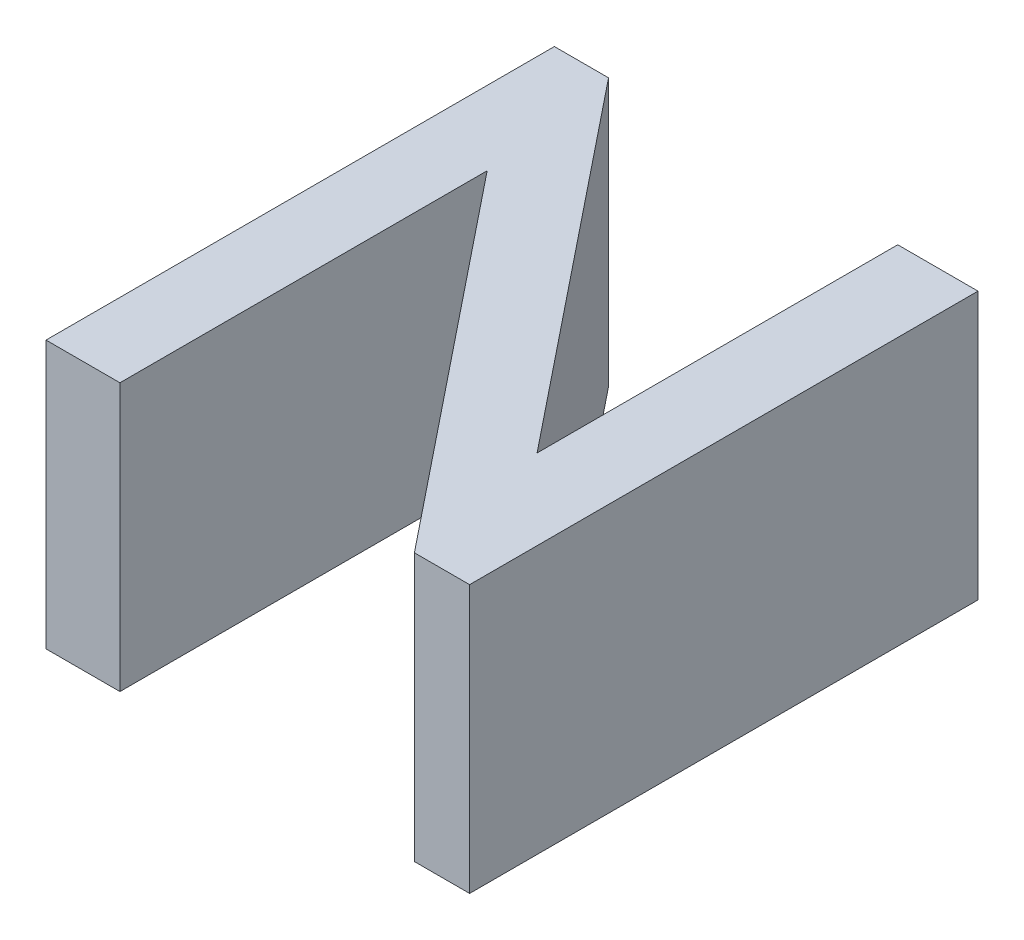
ISO-10303-21;
HEADER;
FILE_DESCRIPTION(('STEP AP214'),'2;1');
FILE_NAME('part.step','',(''),(''),'','','');
FILE_SCHEMA(('AUTOMOTIVE_DESIGN { 1 0 10303 214 1 1 1 1 }'));
ENDSEC;
DATA;
#1=APPLICATION_CONTEXT('core data for automotive mechanical design processes');
#2=APPLICATION_PROTOCOL_DEFINITION('international standard','automotive_design',2000,#1);
#3=PRODUCT_CONTEXT('',#1,'mechanical');
#4=PRODUCT('Part','Part','',(#3));
#5=PRODUCT_RELATED_PRODUCT_CATEGORY('part','',(#4));
#6=PRODUCT_DEFINITION_FORMATION('','',#4);
#7=PRODUCT_DEFINITION_CONTEXT('part definition',#1,'design');
#8=PRODUCT_DEFINITION('design','',#6,#7);
#9=PRODUCT_DEFINITION_SHAPE('','',#8);
#10=(LENGTH_UNIT() NAMED_UNIT(*) SI_UNIT(.MILLI.,.METRE.));
#11=(NAMED_UNIT(*) PLANE_ANGLE_UNIT() SI_UNIT($,.RADIAN.));
#12=(NAMED_UNIT(*) SI_UNIT($,.STERADIAN.) SOLID_ANGLE_UNIT());
#13=UNCERTAINTY_MEASURE_WITH_UNIT(LENGTH_MEASURE(1.E-05),#10,'distance_accuracy_value','');
#14=(GEOMETRIC_REPRESENTATION_CONTEXT(3) GLOBAL_UNCERTAINTY_ASSIGNED_CONTEXT((#13)) GLOBAL_UNIT_ASSIGNED_CONTEXT((#10,
#11,#12)) REPRESENTATION_CONTEXT('',''));
#15=CARTESIAN_POINT('',(0.,0.,0.));
#16=DIRECTION('',(0.,0.,1.));
#17=DIRECTION('',(1.,0.,0.));
#18=AXIS2_PLACEMENT_3D('',#15,#16,#17);
#19=CARTESIAN_POINT('',(260.079347522779,10.,-70.0192436771193));
#20=DIRECTION('',(-1.,0.,0.));
#21=DIRECTION('',(0.,0.,1.));
#22=AXIS2_PLACEMENT_3D('',#19,#20,#21);
#23=PLANE('',#22);
#24=DIRECTION('',(0.,0.,-1.));
#25=VECTOR('',#24,1.);
#26=CARTESIAN_POINT('',(260.079347522779,0.,-70.0192436771193));
#27=LINE('',#26,#25);
#28=CARTESIAN_POINT('',(260.079347522779,0.,-56.28859622837));
#29=VERTEX_POINT('',#28);
#30=CARTESIAN_POINT('',(260.079347522779,0.,-70.0192436771193));
#31=VERTEX_POINT('',#30);
#32=EDGE_CURVE('E138',#29,#31,#27,.T.);
#33=ORIENTED_EDGE('',*,*,#32,.T.);
#34=DIRECTION('',(0.,-1.,0.));
#35=VECTOR('',#34,1.);
#36=CARTESIAN_POINT('',(260.079347522779,10.,-70.0192436771193));
#37=LINE('',#36,#35);
#38=CARTESIAN_POINT('',(260.079347522779,10.,-70.0192436771193));
#39=VERTEX_POINT('',#38);
#40=EDGE_CURVE('E11',#39,#31,#37,.T.);
#41=ORIENTED_EDGE('',*,*,#40,.F.);
#42=DIRECTION('',(0.,0.,-1.));
#43=VECTOR('',#42,1.);
#44=CARTESIAN_POINT('',(260.079347522779,10.,-70.0192436771193));
#45=LINE('',#44,#43);
#46=CARTESIAN_POINT('',(260.079347522779,10.,-56.28859622837));
#47=VERTEX_POINT('',#46);
#48=EDGE_CURVE('E156',#47,#39,#45,.T.);
#49=ORIENTED_EDGE('',*,*,#48,.F.);
#50=DIRECTION('',(0.,-1.,0.));
#51=VECTOR('',#50,1.);
#52=CARTESIAN_POINT('',(260.079347522779,10.,-56.28859622837));
#53=LINE('',#52,#51);
#54=EDGE_CURVE('E134',#47,#29,#53,.T.);
#55=ORIENTED_EDGE('',*,*,#54,.T.);
#56=EDGE_LOOP('',(#33,#41,#49,#55));
#57=FACE_BOUND('',#56,.T.);
#58=ADVANCED_FACE('F30',(#57),#23,.F.);
#59=CARTESIAN_POINT('',(271.089442662359,10.,-56.28859622837));
#60=DIRECTION('',(0.780159396589422,0.,-0.625580782883577));
#61=DIRECTION('',(-0.625580782883577,0.,-0.780159396589422));
#62=AXIS2_PLACEMENT_3D('',#59,#60,#61);
#63=PLANE('',#62);
#64=DIRECTION('',(0.625580782883577,0.,0.780159396589422));
#65=VECTOR('',#64,1.);
#66=CARTESIAN_POINT('',(271.089442662359,0.,-56.28859622837));
#67=LINE('',#66,#65);
#68=CARTESIAN_POINT('',(271.089442662359,0.,-56.28859622837));
#69=VERTEX_POINT('',#68);
#70=EDGE_CURVE('E141',#31,#69,#67,.T.);
#71=ORIENTED_EDGE('',*,*,#70,.T.);
#72=DIRECTION('',(0.,-1.,0.));
#73=VECTOR('',#72,1.);
#74=CARTESIAN_POINT('',(271.089442662359,10.,-56.28859622837));
#75=LINE('',#74,#73);
#76=CARTESIAN_POINT('',(271.089442662359,10.,-56.28859622837));
#77=VERTEX_POINT('',#76);
#78=EDGE_CURVE('E38',#77,#69,#75,.T.);
#79=ORIENTED_EDGE('',*,*,#78,.F.);
#80=DIRECTION('',(0.625580782883577,0.,0.780159396589422));
#81=VECTOR('',#80,1.);
#82=CARTESIAN_POINT('',(271.089442662359,10.,-56.28859622837));
#83=LINE('',#82,#81);
#84=EDGE_CURVE('E95',#39,#77,#83,.T.);
#85=ORIENTED_EDGE('',*,*,#84,.F.);
#86=ORIENTED_EDGE('',*,*,#40,.T.);
#87=EDGE_LOOP('',(#71,#79,#85,#86));
#88=FACE_BOUND('',#87,.T.);
#89=ADVANCED_FACE('F205',(#88),#63,.F.);
#90=CARTESIAN_POINT('',(273.153205955328,10.,-56.28859622837));
#91=DIRECTION('',(0.,0.,-1.));
#92=DIRECTION('',(-1.,0.,0.));
#93=AXIS2_PLACEMENT_3D('',#90,#91,#92);
#94=PLANE('',#93);
#95=DIRECTION('',(1.,0.,0.));
#96=VECTOR('',#95,1.);
#97=CARTESIAN_POINT('',(273.153205955328,0.,-56.28859622837));
#98=LINE('',#97,#96);
#99=CARTESIAN_POINT('',(273.153205955328,0.,-56.28859622837));
#100=VERTEX_POINT('',#99);
#101=EDGE_CURVE('E143',#69,#100,#98,.T.);
#102=ORIENTED_EDGE('',*,*,#101,.T.);
#103=DIRECTION('',(0.,-1.,0.));
#104=VECTOR('',#103,1.);
#105=CARTESIAN_POINT('',(273.153205955328,10.,-56.28859622837));
#106=LINE('',#105,#104);
#107=CARTESIAN_POINT('',(273.153205955328,10.,-56.28859622837));
#108=VERTEX_POINT('',#107);
#109=EDGE_CURVE('E169',#108,#100,#106,.T.);
#110=ORIENTED_EDGE('',*,*,#109,.F.);
#111=DIRECTION('',(1.,0.,0.));
#112=VECTOR('',#111,1.);
#113=CARTESIAN_POINT('',(273.153205955328,10.,-56.28859622837));
#114=LINE('',#113,#112);
#115=EDGE_CURVE('E177',#77,#108,#114,.T.);
#116=ORIENTED_EDGE('',*,*,#115,.F.);
#117=ORIENTED_EDGE('',*,*,#78,.T.);
#118=EDGE_LOOP('',(#102,#110,#116,#117));
#119=FACE_BOUND('',#118,.T.);
#120=ADVANCED_FACE('F175',(#119),#94,.F.);
#121=CARTESIAN_POINT('',(273.153205955328,10.,-75.2974570796293));
#122=DIRECTION('',(-1.,0.,0.));
#123=DIRECTION('',(0.,0.,1.));
#124=AXIS2_PLACEMENT_3D('',#121,#122,#123);
#125=PLANE('',#124);
#126=DIRECTION('',(0.,0.,-1.));
#127=VECTOR('',#126,1.);
#128=CARTESIAN_POINT('',(273.153205955328,0.,-75.2974570796293));
#129=LINE('',#128,#127);
#130=CARTESIAN_POINT('',(273.153205955328,0.,-75.2974570796293));
#131=VERTEX_POINT('',#130);
#132=EDGE_CURVE('E145',#100,#131,#129,.T.);
#133=ORIENTED_EDGE('',*,*,#132,.T.);
#134=DIRECTION('',(0.,-1.,0.));
#135=VECTOR('',#134,1.);
#136=CARTESIAN_POINT('',(273.153205955328,10.,-75.2974570796293));
#137=LINE('',#136,#135);
#138=CARTESIAN_POINT('',(273.153205955328,10.,-75.2974570796293));
#139=VERTEX_POINT('',#138);
#140=EDGE_CURVE('E166',#139,#131,#137,.T.);
#141=ORIENTED_EDGE('',*,*,#140,.F.);
#142=DIRECTION('',(0.,0.,-1.));
#143=VECTOR('',#142,1.);
#144=CARTESIAN_POINT('',(273.153205955328,10.,-75.2974570796293));
#145=LINE('',#144,#143);
#146=EDGE_CURVE('E195',#108,#139,#145,.T.);
#147=ORIENTED_EDGE('',*,*,#146,.F.);
#148=ORIENTED_EDGE('',*,*,#109,.T.);
#149=EDGE_LOOP('',(#133,#141,#147,#148));
#150=FACE_BOUND('',#149,.T.);
#151=ADVANCED_FACE('F186',(#150),#125,.F.);
#152=CARTESIAN_POINT('',(270.151362807418,10.,-75.2974570796293));
#153=DIRECTION('',(0.,0.,1.));
#154=DIRECTION('',(1.,0.,0.));
#155=AXIS2_PLACEMENT_3D('',#152,#153,#154);
#156=PLANE('',#155);
#157=DIRECTION('',(-1.,0.,0.));
#158=VECTOR('',#157,1.);
#159=CARTESIAN_POINT('',(270.151362807418,0.,-75.2974570796293));
#160=LINE('',#159,#158);
#161=CARTESIAN_POINT('',(270.151362807418,0.,-75.2974570796293));
#162=VERTEX_POINT('',#161);
#163=EDGE_CURVE('E147',#131,#162,#160,.T.);
#164=ORIENTED_EDGE('',*,*,#163,.T.);
#165=DIRECTION('',(0.,-1.,0.));
#166=VECTOR('',#165,1.);
#167=CARTESIAN_POINT('',(270.151362807418,10.,-75.2974570796293));
#168=LINE('',#167,#166);
#169=CARTESIAN_POINT('',(270.151362807418,10.,-75.2974570796293));
#170=VERTEX_POINT('',#169);
#171=EDGE_CURVE('E163',#170,#162,#168,.T.);
#172=ORIENTED_EDGE('',*,*,#171,.F.);
#173=DIRECTION('',(-1.,0.,0.));
#174=VECTOR('',#173,1.);
#175=CARTESIAN_POINT('',(270.151362807418,10.,-75.2974570796293));
#176=LINE('',#175,#174);
#177=EDGE_CURVE('E192',#139,#170,#176,.T.);
#178=ORIENTED_EDGE('',*,*,#177,.F.);
#179=ORIENTED_EDGE('',*,*,#140,.T.);
#180=EDGE_LOOP('',(#164,#172,#178,#179));
#181=FACE_BOUND('',#180,.T.);
#182=ADVANCED_FACE('F190',(#181),#156,.F.);
#183=CARTESIAN_POINT('',(270.151362807418,10.,-61.8130992712162));
#184=DIRECTION('',(1.,0.,0.));
#185=DIRECTION('',(0.,0.,-1.));
#186=AXIS2_PLACEMENT_3D('',#183,#184,#185);
#187=PLANE('',#186);
#188=DIRECTION('',(0.,0.,1.));
#189=VECTOR('',#188,1.);
#190=CARTESIAN_POINT('',(270.151362807418,0.,-61.8130992712162));
#191=LINE('',#190,#189);
#192=CARTESIAN_POINT('',(270.151362807418,0.,-61.8130992712162));
#193=VERTEX_POINT('',#192);
#194=EDGE_CURVE('E149',#162,#193,#191,.T.);
#195=ORIENTED_EDGE('',*,*,#194,.T.);
#196=DIRECTION('',(0.,-1.,0.));
#197=VECTOR('',#196,1.);
#198=CARTESIAN_POINT('',(270.151362807418,10.,-61.8130992712162));
#199=LINE('',#198,#197);
#200=CARTESIAN_POINT('',(270.151362807418,10.,-61.8130992712162));
#201=VERTEX_POINT('',#200);
#202=EDGE_CURVE('E160',#201,#193,#199,.T.);
#203=ORIENTED_EDGE('',*,*,#202,.F.);
#204=DIRECTION('',(0.,0.,1.));
#205=VECTOR('',#204,1.);
#206=CARTESIAN_POINT('',(270.151362807418,10.,-61.8130992712162));
#207=LINE('',#206,#205);
#208=EDGE_CURVE('E194',#170,#201,#207,.T.);
#209=ORIENTED_EDGE('',*,*,#208,.F.);
#210=ORIENTED_EDGE('',*,*,#171,.T.);
#211=EDGE_LOOP('',(#195,#203,#209,#210));
#212=FACE_BOUND('',#211,.T.);
#213=ADVANCED_FACE('F217',(#212),#187,.F.);
#214=CARTESIAN_POINT('',(259.338758163615,10.,-75.2974570796293));
#215=DIRECTION('',(-0.780159396589425,0.,0.625580782883574));
#216=DIRECTION('',(0.625580782883574,0.,0.780159396589425));
#217=AXIS2_PLACEMENT_3D('',#214,#215,#216);
#218=PLANE('',#217);
#219=DIRECTION('',(-0.625580782883574,0.,-0.780159396589425));
#220=VECTOR('',#219,1.);
#221=CARTESIAN_POINT('',(259.338758163615,0.,-75.2974570796293));
#222=LINE('',#221,#220);
#223=CARTESIAN_POINT('',(259.338758163615,0.,-75.2974570796293));
#224=VERTEX_POINT('',#223);
#225=EDGE_CURVE('E151',#193,#224,#222,.T.);
#226=ORIENTED_EDGE('',*,*,#225,.T.);
#227=DIRECTION('',(0.,-1.,0.));
#228=VECTOR('',#227,1.);
#229=CARTESIAN_POINT('',(259.338758163615,10.,-75.2974570796293));
#230=LINE('',#229,#228);
#231=CARTESIAN_POINT('',(259.338758163615,10.,-75.2974570796293));
#232=VERTEX_POINT('',#231);
#233=EDGE_CURVE('E129',#232,#224,#230,.T.);
#234=ORIENTED_EDGE('',*,*,#233,.F.);
#235=DIRECTION('',(-0.625580782883574,0.,-0.780159396589425));
#236=VECTOR('',#235,1.);
#237=CARTESIAN_POINT('',(259.338758163615,10.,-75.2974570796293));
#238=LINE('',#237,#236);
#239=EDGE_CURVE('E120',#201,#232,#238,.T.);
#240=ORIENTED_EDGE('',*,*,#239,.F.);
#241=ORIENTED_EDGE('',*,*,#202,.T.);
#242=EDGE_LOOP('',(#226,#234,#240,#241));
#243=FACE_BOUND('',#242,.T.);
#244=ADVANCED_FACE('F220',(#243),#218,.F.);
#245=CARTESIAN_POINT('',(257.314480581898,10.,-75.2974570796293));
#246=DIRECTION('',(0.,0.,1.));
#247=DIRECTION('',(1.,0.,0.));
#248=AXIS2_PLACEMENT_3D('',#245,#246,#247);
#249=PLANE('',#248);
#250=DIRECTION('',(-1.,0.,0.));
#251=VECTOR('',#250,1.);
#252=CARTESIAN_POINT('',(257.314480581898,0.,-75.2974570796293));
#253=LINE('',#252,#251);
#254=CARTESIAN_POINT('',(257.314480581898,0.,-75.2974570796293));
#255=VERTEX_POINT('',#254);
#256=EDGE_CURVE('E128',#224,#255,#253,.T.);
#257=ORIENTED_EDGE('',*,*,#256,.T.);
#258=DIRECTION('',(0.,-1.,0.));
#259=VECTOR('',#258,1.);
#260=CARTESIAN_POINT('',(257.314480581898,10.,-75.2974570796293));
#261=LINE('',#260,#259);
#262=CARTESIAN_POINT('',(257.314480581898,10.,-75.2974570796293));
#263=VERTEX_POINT('',#262);
#264=EDGE_CURVE('E125',#263,#255,#261,.T.);
#265=ORIENTED_EDGE('',*,*,#264,.F.);
#266=DIRECTION('',(-1.,0.,0.));
#267=VECTOR('',#266,1.);
#268=CARTESIAN_POINT('',(257.314480581898,10.,-75.2974570796293));
#269=LINE('',#268,#267);
#270=EDGE_CURVE('E114',#232,#263,#269,.T.);
#271=ORIENTED_EDGE('',*,*,#270,.F.);
#272=ORIENTED_EDGE('',*,*,#233,.T.);
#273=EDGE_LOOP('',(#257,#265,#271,#272));
#274=FACE_BOUND('',#273,.T.);
#275=ADVANCED_FACE('F126',(#274),#249,.F.);
#276=CARTESIAN_POINT('',(257.314480581898,10.,-56.28859622837));
#277=DIRECTION('',(1.,0.,0.));
#278=DIRECTION('',(0.,0.,-1.));
#279=AXIS2_PLACEMENT_3D('',#276,#277,#278);
#280=PLANE('',#279);
#281=DIRECTION('',(0.,0.,1.));
#282=VECTOR('',#281,1.);
#283=CARTESIAN_POINT('',(257.314480581898,0.,-56.28859622837));
#284=LINE('',#283,#282);
#285=CARTESIAN_POINT('',(257.314480581898,0.,-56.28859622837));
#286=VERTEX_POINT('',#285);
#287=EDGE_CURVE('E81',#255,#286,#284,.T.);
#288=ORIENTED_EDGE('',*,*,#287,.T.);
#289=DIRECTION('',(0.,-1.,0.));
#290=VECTOR('',#289,1.);
#291=CARTESIAN_POINT('',(257.314480581898,10.,-56.28859622837));
#292=LINE('',#291,#290);
#293=CARTESIAN_POINT('',(257.314480581898,10.,-56.28859622837));
#294=VERTEX_POINT('',#293);
#295=EDGE_CURVE('E130',#294,#286,#292,.T.);
#296=ORIENTED_EDGE('',*,*,#295,.F.);
#297=DIRECTION('',(0.,0.,1.));
#298=VECTOR('',#297,1.);
#299=CARTESIAN_POINT('',(257.314480581898,10.,-56.28859622837));
#300=LINE('',#299,#298);
#301=EDGE_CURVE('E118',#263,#294,#300,.T.);
#302=ORIENTED_EDGE('',*,*,#301,.F.);
#303=ORIENTED_EDGE('',*,*,#264,.T.);
#304=EDGE_LOOP('',(#288,#296,#302,#303));
#305=FACE_BOUND('',#304,.T.);
#306=ADVANCED_FACE('F132',(#305),#280,.F.);
#307=CARTESIAN_POINT('',(260.079347522779,10.,-56.28859622837));
#308=DIRECTION('',(0.,0.,-1.));
#309=DIRECTION('',(-1.,0.,0.));
#310=AXIS2_PLACEMENT_3D('',#307,#308,#309);
#311=PLANE('',#310);
#312=DIRECTION('',(1.,0.,0.));
#313=VECTOR('',#312,1.);
#314=CARTESIAN_POINT('',(260.079347522779,0.,-56.28859622837));
#315=LINE('',#314,#313);
#316=EDGE_CURVE('E87',#286,#29,#315,.T.);
#317=ORIENTED_EDGE('',*,*,#316,.T.);
#318=ORIENTED_EDGE('',*,*,#54,.F.);
#319=DIRECTION('',(1.,0.,0.));
#320=VECTOR('',#319,1.);
#321=CARTESIAN_POINT('',(260.079347522779,10.,-56.28859622837));
#322=LINE('',#321,#320);
#323=EDGE_CURVE('E46',#294,#47,#322,.T.);
#324=ORIENTED_EDGE('',*,*,#323,.F.);
#325=ORIENTED_EDGE('',*,*,#295,.T.);
#326=EDGE_LOOP('',(#317,#318,#324,#325));
#327=FACE_BOUND('',#326,.T.);
#328=ADVANCED_FACE('F229',(#327),#311,.F.);
#329=CARTESIAN_POINT('',(0.,10.,0.));
#330=DIRECTION('',(0.,-1.,0.));
#331=DIRECTION('',(0.,0.,-1.));
#332=AXIS2_PLACEMENT_3D('',#329,#330,#331);
#333=PLANE('',#332);
#334=ORIENTED_EDGE('',*,*,#48,.T.);
#335=ORIENTED_EDGE('',*,*,#84,.T.);
#336=ORIENTED_EDGE('',*,*,#115,.T.);
#337=ORIENTED_EDGE('',*,*,#146,.T.);
#338=ORIENTED_EDGE('',*,*,#177,.T.);
#339=ORIENTED_EDGE('',*,*,#208,.T.);
#340=ORIENTED_EDGE('',*,*,#239,.T.);
#341=ORIENTED_EDGE('',*,*,#270,.T.);
#342=ORIENTED_EDGE('',*,*,#301,.T.);
#343=ORIENTED_EDGE('',*,*,#323,.T.);
#344=EDGE_LOOP('',(#334,#335,#336,#337,#338,#339,#340,#341,#342,#343));
#345=FACE_BOUND('',#344,.T.);
#346=ADVANCED_FACE('F116',(#345),#333,.F.);
#347=CARTESIAN_POINT('',(0.,0.,0.));
#348=DIRECTION('',(0.,-1.,0.));
#349=DIRECTION('',(0.,0.,-1.));
#350=AXIS2_PLACEMENT_3D('',#347,#348,#349);
#351=PLANE('',#350);
#352=ORIENTED_EDGE('',*,*,#32,.F.);
#353=ORIENTED_EDGE('',*,*,#316,.F.);
#354=ORIENTED_EDGE('',*,*,#287,.F.);
#355=ORIENTED_EDGE('',*,*,#256,.F.);
#356=ORIENTED_EDGE('',*,*,#225,.F.);
#357=ORIENTED_EDGE('',*,*,#194,.F.);
#358=ORIENTED_EDGE('',*,*,#163,.F.);
#359=ORIENTED_EDGE('',*,*,#132,.F.);
#360=ORIENTED_EDGE('',*,*,#101,.F.);
#361=ORIENTED_EDGE('',*,*,#70,.F.);
#362=EDGE_LOOP('',(#352,#353,#354,#355,#356,#357,#358,#359,#360,#361));
#363=FACE_BOUND('',#362,.T.);
#364=ADVANCED_FACE('F181',(#363),#351,.T.);
#365=CLOSED_SHELL('',(#58,#89,#120,#151,#182,#213,#244,#275,#306,#328,#346,#364));
#366=MANIFOLD_SOLID_BREP('B2',#365);
#367=ADVANCED_BREP_SHAPE_REPRESENTATION('',(#18,#366),#14);
#368=SHAPE_DEFINITION_REPRESENTATION(#9,#367);
ENDSEC;
END-ISO-10303-21;
